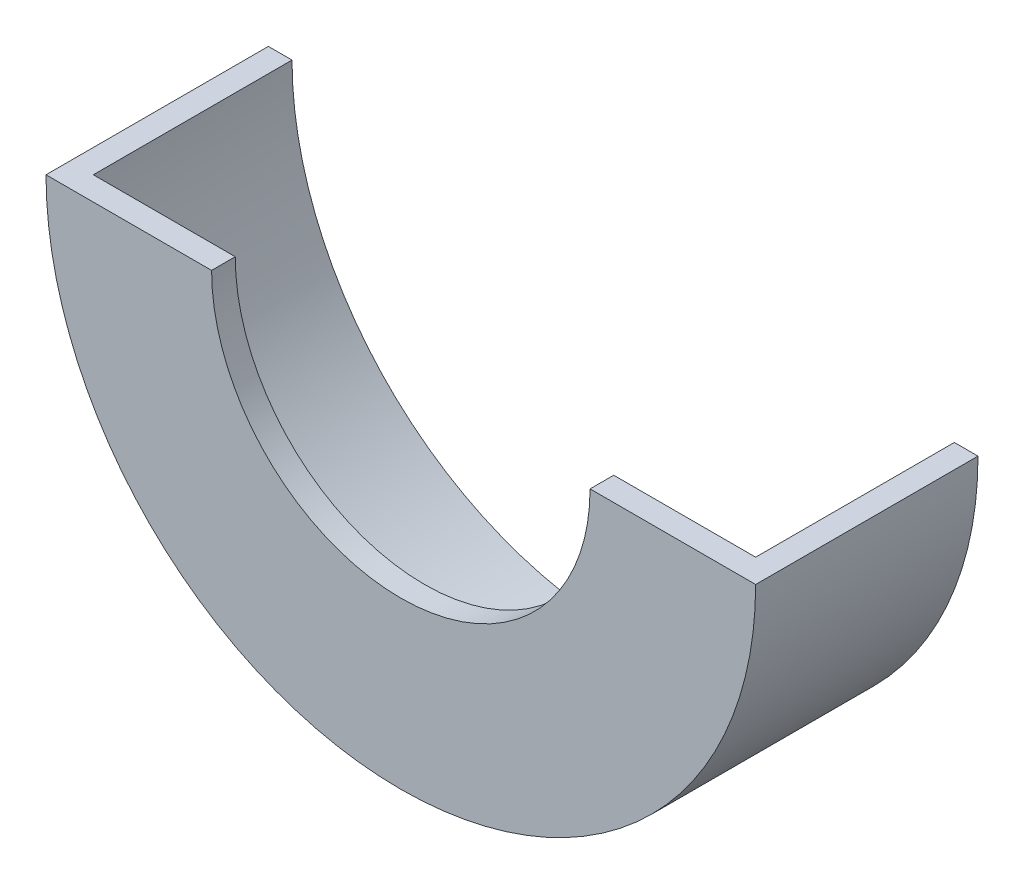
ISO-10303-21;
HEADER;
FILE_DESCRIPTION(('STEP AP214'),'2;1');
FILE_NAME('part.step','',(''),(''),'','','');
FILE_SCHEMA(('AUTOMOTIVE_DESIGN { 1 0 10303 214 1 1 1 1 }'));
ENDSEC;
DATA;
#1=APPLICATION_CONTEXT('core data for automotive mechanical design processes');
#2=APPLICATION_PROTOCOL_DEFINITION('international standard','automotive_design',2000,#1);
#3=PRODUCT_CONTEXT('',#1,'mechanical');
#4=PRODUCT('Part','Part','',(#3));
#5=PRODUCT_RELATED_PRODUCT_CATEGORY('part','',(#4));
#6=PRODUCT_DEFINITION_FORMATION('','',#4);
#7=PRODUCT_DEFINITION_CONTEXT('part definition',#1,'design');
#8=PRODUCT_DEFINITION('design','',#6,#7);
#9=PRODUCT_DEFINITION_SHAPE('','',#8);
#10=(LENGTH_UNIT() NAMED_UNIT(*) SI_UNIT(.MILLI.,.METRE.));
#11=(NAMED_UNIT(*) PLANE_ANGLE_UNIT() SI_UNIT($,.RADIAN.));
#12=(NAMED_UNIT(*) SI_UNIT($,.STERADIAN.) SOLID_ANGLE_UNIT());
#13=UNCERTAINTY_MEASURE_WITH_UNIT(LENGTH_MEASURE(1.E-05),#10,'distance_accuracy_value','');
#14=(GEOMETRIC_REPRESENTATION_CONTEXT(3) GLOBAL_UNCERTAINTY_ASSIGNED_CONTEXT((#13)) GLOBAL_UNIT_ASSIGNED_CONTEXT((#10,
#11,#12)) REPRESENTATION_CONTEXT('',''));
#15=CARTESIAN_POINT('',(0.,0.,0.));
#16=DIRECTION('',(0.,0.,1.));
#17=DIRECTION('',(1.,0.,0.));
#18=AXIS2_PLACEMENT_3D('',#15,#16,#17);
#19=CARTESIAN_POINT('',(0.,0.,42.));
#20=DIRECTION('',(0.,0.,-1.));
#21=DIRECTION('',(-1.,0.,0.));
#22=AXIS2_PLACEMENT_3D('',#19,#20,#21);
#23=CYLINDRICAL_SURFACE('',#22,70.);
#24=CARTESIAN_POINT('',(0.,0.,0.));
#25=DIRECTION('',(0.,0.,1.));
#26=DIRECTION('',(1.,0.,0.));
#27=AXIS2_PLACEMENT_3D('',#24,#25,#26);
#28=CIRCLE('',#27,70.);
#29=CARTESIAN_POINT('',(-70.,0.,0.));
#30=VERTEX_POINT('',#29);
#31=CARTESIAN_POINT('',(70.,0.,0.));
#32=VERTEX_POINT('',#31);
#33=EDGE_CURVE('E97',#30,#32,#28,.T.);
#34=ORIENTED_EDGE('',*,*,#33,.F.);
#35=DIRECTION('',(0.,0.,-1.));
#36=VECTOR('',#35,1.);
#37=CARTESIAN_POINT('',(-70.,0.,42.));
#38=LINE('',#37,#36);
#39=CARTESIAN_POINT('',(-70.,0.,42.));
#40=VERTEX_POINT('',#39);
#41=EDGE_CURVE('E11',#40,#30,#38,.T.);
#42=ORIENTED_EDGE('',*,*,#41,.F.);
#43=CARTESIAN_POINT('',(0.,0.,42.));
#44=DIRECTION('',(0.,0.,1.));
#45=DIRECTION('',(1.,0.,0.));
#46=AXIS2_PLACEMENT_3D('',#43,#44,#45);
#47=CIRCLE('',#46,70.);
#48=CARTESIAN_POINT('',(70.,0.,42.));
#49=VERTEX_POINT('',#48);
#50=EDGE_CURVE('E98',#40,#49,#47,.T.);
#51=ORIENTED_EDGE('',*,*,#50,.T.);
#52=DIRECTION('',(0.,0.,-1.));
#53=VECTOR('',#52,1.);
#54=CARTESIAN_POINT('',(70.,0.,42.));
#55=LINE('',#54,#53);
#56=EDGE_CURVE('E83',#49,#32,#55,.T.);
#57=ORIENTED_EDGE('',*,*,#56,.T.);
#58=EDGE_LOOP('',(#34,#42,#51,#57));
#59=FACE_BOUND('',#58,.T.);
#60=ADVANCED_FACE('F39',(#59),#23,.F.);
#61=CARTESIAN_POINT('',(0.,0.,42.));
#62=DIRECTION('',(0.,1.,0.));
#63=DIRECTION('',(-1.,0.,0.));
#64=AXIS2_PLACEMENT_3D('',#61,#62,#63);
#65=PLANE('',#64);
#66=DIRECTION('',(1.,0.,0.));
#67=VECTOR('',#66,1.);
#68=CARTESIAN_POINT('',(0.,0.,0.));
#69=LINE('',#68,#67);
#70=CARTESIAN_POINT('',(-75.,0.,0.));
#71=VERTEX_POINT('',#70);
#72=EDGE_CURVE('E92',#71,#30,#69,.T.);
#73=ORIENTED_EDGE('',*,*,#72,.F.);
#74=DIRECTION('',(0.,0.,-1.));
#75=VECTOR('',#74,1.);
#76=CARTESIAN_POINT('',(-75.,0.,42.));
#77=LINE('',#76,#75);
#78=CARTESIAN_POINT('',(-75.,0.,47.));
#79=VERTEX_POINT('',#78);
#80=EDGE_CURVE('E47',#79,#71,#77,.T.);
#81=ORIENTED_EDGE('',*,*,#80,.F.);
#82=DIRECTION('',(-1.,0.,0.));
#83=VECTOR('',#82,1.);
#84=CARTESIAN_POINT('',(0.,0.,47.));
#85=LINE('',#84,#83);
#86=CARTESIAN_POINT('',(-40.,0.,47.));
#87=VERTEX_POINT('',#86);
#88=EDGE_CURVE('E118',#87,#79,#85,.T.);
#89=ORIENTED_EDGE('',*,*,#88,.F.);
#90=DIRECTION('',(0.,0.,-1.));
#91=VECTOR('',#90,1.);
#92=CARTESIAN_POINT('',(-40.,0.,47.));
#93=LINE('',#92,#91);
#94=CARTESIAN_POINT('',(-40.,0.,42.));
#95=VERTEX_POINT('',#94);
#96=EDGE_CURVE('E105',#87,#95,#93,.T.);
#97=ORIENTED_EDGE('',*,*,#96,.T.);
#98=DIRECTION('',(-1.,0.,0.));
#99=VECTOR('',#98,1.);
#100=CARTESIAN_POINT('',(0.,0.,42.));
#101=LINE('',#100,#99);
#102=EDGE_CURVE('E111',#95,#40,#101,.T.);
#103=ORIENTED_EDGE('',*,*,#102,.T.);
#104=ORIENTED_EDGE('',*,*,#41,.T.);
#105=EDGE_LOOP('',(#73,#81,#89,#97,#103,#104));
#106=FACE_BOUND('',#105,.T.);
#107=ADVANCED_FACE('F141',(#106),#65,.T.);
#108=CARTESIAN_POINT('',(0.,0.,42.));
#109=DIRECTION('',(0.,0.,-1.));
#110=DIRECTION('',(-1.,0.,0.));
#111=AXIS2_PLACEMENT_3D('',#108,#109,#110);
#112=CYLINDRICAL_SURFACE('',#111,75.);
#113=CARTESIAN_POINT('',(0.,0.,0.));
#114=DIRECTION('',(0.,0.,1.));
#115=DIRECTION('',(1.,0.,0.));
#116=AXIS2_PLACEMENT_3D('',#113,#114,#115);
#117=CIRCLE('',#116,75.);
#118=CARTESIAN_POINT('',(75.,0.,0.));
#119=VERTEX_POINT('',#118);
#120=EDGE_CURVE('E86',#71,#119,#117,.T.);
#121=ORIENTED_EDGE('',*,*,#120,.T.);
#122=DIRECTION('',(0.,0.,-1.));
#123=VECTOR('',#122,1.);
#124=CARTESIAN_POINT('',(75.,0.,42.));
#125=LINE('',#124,#123);
#126=CARTESIAN_POINT('',(75.,0.,47.));
#127=VERTEX_POINT('',#126);
#128=EDGE_CURVE('E71',#127,#119,#125,.T.);
#129=ORIENTED_EDGE('',*,*,#128,.F.);
#130=CARTESIAN_POINT('',(0.,0.,47.));
#131=DIRECTION('',(0.,0.,1.));
#132=DIRECTION('',(1.,0.,0.));
#133=AXIS2_PLACEMENT_3D('',#130,#131,#132);
#134=CIRCLE('',#133,75.);
#135=EDGE_CURVE('E110',#79,#127,#134,.T.);
#136=ORIENTED_EDGE('',*,*,#135,.F.);
#137=ORIENTED_EDGE('',*,*,#80,.T.);
#138=EDGE_LOOP('',(#121,#129,#136,#137));
#139=FACE_BOUND('',#138,.T.);
#140=ADVANCED_FACE('F87',(#139),#112,.T.);
#141=EDGE_CURVE('E75',#32,#119,#69,.T.);
#142=ORIENTED_EDGE('',*,*,#141,.F.);
#143=ORIENTED_EDGE('',*,*,#56,.F.);
#144=DIRECTION('',(-1.,0.,0.));
#145=VECTOR('',#144,1.);
#146=CARTESIAN_POINT('',(0.,0.,42.));
#147=LINE('',#146,#145);
#148=CARTESIAN_POINT('',(40.,0.,42.));
#149=VERTEX_POINT('',#148);
#150=EDGE_CURVE('E54',#49,#149,#147,.T.);
#151=ORIENTED_EDGE('',*,*,#150,.T.);
#152=DIRECTION('',(0.,0.,-1.));
#153=VECTOR('',#152,1.);
#154=CARTESIAN_POINT('',(40.,0.,47.));
#155=LINE('',#154,#153);
#156=CARTESIAN_POINT('',(40.,0.,47.));
#157=VERTEX_POINT('',#156);
#158=EDGE_CURVE('E103',#157,#149,#155,.T.);
#159=ORIENTED_EDGE('',*,*,#158,.F.);
#160=DIRECTION('',(-1.,0.,0.));
#161=VECTOR('',#160,1.);
#162=CARTESIAN_POINT('',(0.,0.,47.));
#163=LINE('',#162,#161);
#164=EDGE_CURVE('E79',#127,#157,#163,.T.);
#165=ORIENTED_EDGE('',*,*,#164,.F.);
#166=ORIENTED_EDGE('',*,*,#128,.T.);
#167=EDGE_LOOP('',(#142,#143,#151,#159,#165,#166));
#168=FACE_BOUND('',#167,.T.);
#169=ADVANCED_FACE('F73',(#168),#65,.T.);
#170=CARTESIAN_POINT('',(0.,0.,0.));
#171=DIRECTION('',(0.,0.,1.));
#172=DIRECTION('',(1.,0.,0.));
#173=AXIS2_PLACEMENT_3D('',#170,#171,#172);
#174=PLANE('',#173);
#175=ORIENTED_EDGE('',*,*,#33,.T.);
#176=ORIENTED_EDGE('',*,*,#141,.T.);
#177=ORIENTED_EDGE('',*,*,#120,.F.);
#178=ORIENTED_EDGE('',*,*,#72,.T.);
#179=EDGE_LOOP('',(#175,#176,#177,#178));
#180=FACE_BOUND('',#179,.T.);
#181=ADVANCED_FACE('F95',(#180),#174,.F.);
#182=CARTESIAN_POINT('',(0.,0.,42.));
#183=DIRECTION('',(0.,0.,1.));
#184=DIRECTION('',(1.,0.,0.));
#185=AXIS2_PLACEMENT_3D('',#182,#183,#184);
#186=PLANE('',#185);
#187=ORIENTED_EDGE('',*,*,#50,.F.);
#188=ORIENTED_EDGE('',*,*,#102,.F.);
#189=CARTESIAN_POINT('',(0.,0.,42.));
#190=DIRECTION('',(0.,0.,1.));
#191=DIRECTION('',(1.,0.,0.));
#192=AXIS2_PLACEMENT_3D('',#189,#190,#191);
#193=CIRCLE('',#192,40.);
#194=EDGE_CURVE('E114',#95,#149,#193,.T.);
#195=ORIENTED_EDGE('',*,*,#194,.T.);
#196=ORIENTED_EDGE('',*,*,#150,.F.);
#197=EDGE_LOOP('',(#187,#188,#195,#196));
#198=FACE_BOUND('',#197,.T.);
#199=ADVANCED_FACE('F145',(#198),#186,.F.);
#200=CARTESIAN_POINT('',(0.,0.,47.));
#201=DIRECTION('',(0.,0.,-1.));
#202=DIRECTION('',(-1.,0.,0.));
#203=AXIS2_PLACEMENT_3D('',#200,#201,#202);
#204=CYLINDRICAL_SURFACE('',#203,40.);
#205=ORIENTED_EDGE('',*,*,#194,.F.);
#206=ORIENTED_EDGE('',*,*,#96,.F.);
#207=CARTESIAN_POINT('',(0.,0.,47.));
#208=DIRECTION('',(0.,0.,1.));
#209=DIRECTION('',(1.,0.,0.));
#210=AXIS2_PLACEMENT_3D('',#207,#208,#209);
#211=CIRCLE('',#210,40.);
#212=EDGE_CURVE('E121',#87,#157,#211,.T.);
#213=ORIENTED_EDGE('',*,*,#212,.T.);
#214=ORIENTED_EDGE('',*,*,#158,.T.);
#215=EDGE_LOOP('',(#205,#206,#213,#214));
#216=FACE_BOUND('',#215,.T.);
#217=ADVANCED_FACE('F135',(#216),#204,.F.);
#218=CARTESIAN_POINT('',(0.,0.,47.));
#219=DIRECTION('',(0.,0.,1.));
#220=DIRECTION('',(1.,0.,0.));
#221=AXIS2_PLACEMENT_3D('',#218,#219,#220);
#222=PLANE('',#221);
#223=ORIENTED_EDGE('',*,*,#164,.T.);
#224=ORIENTED_EDGE('',*,*,#212,.F.);
#225=ORIENTED_EDGE('',*,*,#88,.T.);
#226=ORIENTED_EDGE('',*,*,#135,.T.);
#227=EDGE_LOOP('',(#223,#224,#225,#226));
#228=FACE_BOUND('',#227,.T.);
#229=ADVANCED_FACE('F127',(#228),#222,.T.);
#230=CLOSED_SHELL('',(#60,#107,#140,#169,#181,#199,#217,#229));
#231=MANIFOLD_SOLID_BREP('B2',#230);
#232=ADVANCED_BREP_SHAPE_REPRESENTATION('',(#18,#231),#14);
#233=SHAPE_DEFINITION_REPRESENTATION(#9,#232);
ENDSEC;
END-ISO-10303-21;
